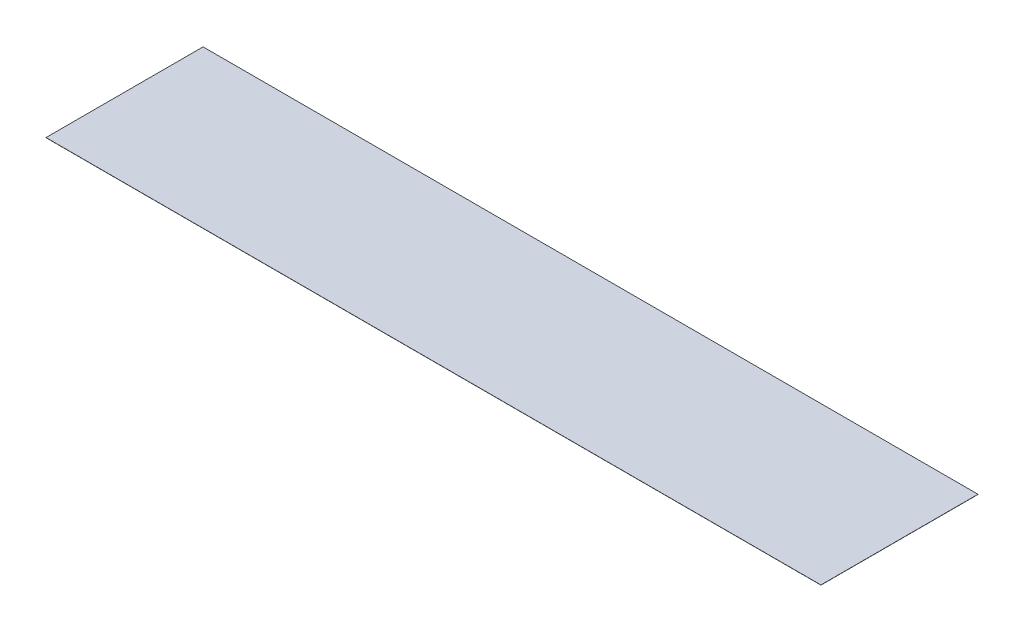
ISO-10303-21;
HEADER;
FILE_DESCRIPTION(('STEP AP214'),'2;1');
FILE_NAME('part.step','',(''),(''),'','','');
FILE_SCHEMA(('AUTOMOTIVE_DESIGN { 1 0 10303 214 1 1 1 1 }'));
ENDSEC;
DATA;
#1=APPLICATION_CONTEXT('core data for automotive mechanical design processes');
#2=APPLICATION_PROTOCOL_DEFINITION('international standard','automotive_design',2000,#1);
#3=PRODUCT_CONTEXT('',#1,'mechanical');
#4=PRODUCT('Part','Part','',(#3));
#5=PRODUCT_RELATED_PRODUCT_CATEGORY('part','',(#4));
#6=PRODUCT_DEFINITION_FORMATION('','',#4);
#7=PRODUCT_DEFINITION_CONTEXT('part definition',#1,'design');
#8=PRODUCT_DEFINITION('design','',#6,#7);
#9=PRODUCT_DEFINITION_SHAPE('','',#8);
#10=(LENGTH_UNIT() NAMED_UNIT(*) SI_UNIT(.MILLI.,.METRE.));
#11=(NAMED_UNIT(*) PLANE_ANGLE_UNIT() SI_UNIT($,.RADIAN.));
#12=(NAMED_UNIT(*) SI_UNIT($,.STERADIAN.) SOLID_ANGLE_UNIT());
#13=UNCERTAINTY_MEASURE_WITH_UNIT(LENGTH_MEASURE(1.E-05),#10,'distance_accuracy_value','');
#14=(GEOMETRIC_REPRESENTATION_CONTEXT(3) GLOBAL_UNCERTAINTY_ASSIGNED_CONTEXT((#13)) GLOBAL_UNIT_ASSIGNED_CONTEXT((#10,
#11,#12)) REPRESENTATION_CONTEXT('',''));
#15=CARTESIAN_POINT('',(0.,0.,0.));
#16=DIRECTION('',(0.,0.,1.));
#17=DIRECTION('',(1.,0.,0.));
#18=AXIS2_PLACEMENT_3D('',#15,#16,#17);
#19=CARTESIAN_POINT('',(-11277.6,4.7752,0.));
#20=DIRECTION('',(1.,0.,0.));
#21=DIRECTION('',(0.,0.,-1.));
#22=AXIS2_PLACEMENT_3D('',#19,#20,#21);
#23=PLANE('',#22);
#24=DIRECTION('',(0.,0.,1.));
#25=VECTOR('',#24,1.);
#26=CARTESIAN_POINT('',(-11277.6,0.,0.));
#27=LINE('',#26,#25);
#28=CARTESIAN_POINT('',(-11277.6,0.,-4572.));
#29=VERTEX_POINT('',#28);
#30=CARTESIAN_POINT('',(-11277.6,0.,0.));
#31=VERTEX_POINT('',#30);
#32=EDGE_CURVE('E102',#29,#31,#27,.T.);
#33=ORIENTED_EDGE('',*,*,#32,.T.);
#34=DIRECTION('',(0.,-1.,0.));
#35=VECTOR('',#34,1.);
#36=CARTESIAN_POINT('',(-11277.6,4.7752,0.));
#37=LINE('',#36,#35);
#38=CARTESIAN_POINT('',(-11277.6,4.7752,0.));
#39=VERTEX_POINT('',#38);
#40=EDGE_CURVE('E11',#39,#31,#37,.T.);
#41=ORIENTED_EDGE('',*,*,#40,.F.);
#42=DIRECTION('',(0.,0.,1.));
#43=VECTOR('',#42,1.);
#44=CARTESIAN_POINT('',(-11277.6,4.7752,0.));
#45=LINE('',#44,#43);
#46=CARTESIAN_POINT('',(-11277.6,4.7752,-4572.));
#47=VERTEX_POINT('',#46);
#48=EDGE_CURVE('E90',#47,#39,#45,.T.);
#49=ORIENTED_EDGE('',*,*,#48,.F.);
#50=DIRECTION('',(0.,-1.,0.));
#51=VECTOR('',#50,1.);
#52=CARTESIAN_POINT('',(-11277.6,4.7752,-4572.));
#53=LINE('',#52,#51);
#54=EDGE_CURVE('E98',#47,#29,#53,.T.);
#55=ORIENTED_EDGE('',*,*,#54,.T.);
#56=EDGE_LOOP('',(#33,#41,#49,#55));
#57=FACE_BOUND('',#56,.T.);
#58=ADVANCED_FACE('F39',(#57),#23,.F.);
#59=CARTESIAN_POINT('',(-11277.6,4.7752,0.));
#60=DIRECTION('',(0.,0.,-1.));
#61=DIRECTION('',(-1.,0.,0.));
#62=AXIS2_PLACEMENT_3D('',#59,#60,#61);
#63=PLANE('',#62);
#64=DIRECTION('',(1.,0.,0.));
#65=VECTOR('',#64,1.);
#66=CARTESIAN_POINT('',(-11277.6,0.,0.));
#67=LINE('',#66,#65);
#68=CARTESIAN_POINT('',(11277.6,0.,-4.21884749357559E-12));
#69=VERTEX_POINT('',#68);
#70=EDGE_CURVE('E94',#31,#69,#67,.T.);
#71=ORIENTED_EDGE('',*,*,#70,.T.);
#72=DIRECTION('',(0.,-1.,0.));
#73=VECTOR('',#72,1.);
#74=CARTESIAN_POINT('',(11277.6,4.7752,-4.21884749357559E-12));
#75=LINE('',#74,#73);
#76=CARTESIAN_POINT('',(11277.6,4.7752,-4.21884749357559E-12));
#77=VERTEX_POINT('',#76);
#78=EDGE_CURVE('E47',#77,#69,#75,.T.);
#79=ORIENTED_EDGE('',*,*,#78,.F.);
#80=DIRECTION('',(1.,0.,0.));
#81=VECTOR('',#80,1.);
#82=CARTESIAN_POINT('',(-11277.6,4.7752,0.));
#83=LINE('',#82,#81);
#84=EDGE_CURVE('E85',#39,#77,#83,.T.);
#85=ORIENTED_EDGE('',*,*,#84,.F.);
#86=ORIENTED_EDGE('',*,*,#40,.T.);
#87=EDGE_LOOP('',(#71,#79,#85,#86));
#88=FACE_BOUND('',#87,.T.);
#89=ADVANCED_FACE('F93',(#88),#63,.F.);
#90=CARTESIAN_POINT('',(11277.6,4.7752,-4.21884749357559E-12));
#91=DIRECTION('',(-1.,0.,0.));
#92=DIRECTION('',(0.,0.,1.));
#93=AXIS2_PLACEMENT_3D('',#90,#91,#92);
#94=PLANE('',#93);
#95=DIRECTION('',(0.,0.,-1.));
#96=VECTOR('',#95,1.);
#97=CARTESIAN_POINT('',(11277.6,0.,-4.21884749357559E-12));
#98=LINE('',#97,#96);
#99=CARTESIAN_POINT('',(11277.6,0.,-4572.));
#100=VERTEX_POINT('',#99);
#101=EDGE_CURVE('E72',#69,#100,#98,.T.);
#102=ORIENTED_EDGE('',*,*,#101,.T.);
#103=DIRECTION('',(0.,-1.,0.));
#104=VECTOR('',#103,1.);
#105=CARTESIAN_POINT('',(11277.6,4.7752,-4572.));
#106=LINE('',#105,#104);
#107=CARTESIAN_POINT('',(11277.6,4.7752,-4572.));
#108=VERTEX_POINT('',#107);
#109=EDGE_CURVE('E95',#108,#100,#106,.T.);
#110=ORIENTED_EDGE('',*,*,#109,.F.);
#111=DIRECTION('',(0.,0.,-1.));
#112=VECTOR('',#111,1.);
#113=CARTESIAN_POINT('',(11277.6,4.7752,-4.21884749357559E-12));
#114=LINE('',#113,#112);
#115=EDGE_CURVE('E88',#77,#108,#114,.T.);
#116=ORIENTED_EDGE('',*,*,#115,.F.);
#117=ORIENTED_EDGE('',*,*,#78,.T.);
#118=EDGE_LOOP('',(#102,#110,#116,#117));
#119=FACE_BOUND('',#118,.T.);
#120=ADVANCED_FACE('F96',(#119),#94,.F.);
#121=CARTESIAN_POINT('',(-11277.6,4.7752,-4572.));
#122=DIRECTION('',(0.,0.,1.));
#123=DIRECTION('',(1.,0.,0.));
#124=AXIS2_PLACEMENT_3D('',#121,#122,#123);
#125=PLANE('',#124);
#126=DIRECTION('',(-1.,0.,0.));
#127=VECTOR('',#126,1.);
#128=CARTESIAN_POINT('',(-11277.6,0.,-4572.));
#129=LINE('',#128,#127);
#130=EDGE_CURVE('E78',#100,#29,#129,.T.);
#131=ORIENTED_EDGE('',*,*,#130,.T.);
#132=ORIENTED_EDGE('',*,*,#54,.F.);
#133=DIRECTION('',(-1.,0.,0.));
#134=VECTOR('',#133,1.);
#135=CARTESIAN_POINT('',(-11277.6,4.7752,-4572.));
#136=LINE('',#135,#134);
#137=EDGE_CURVE('E55',#108,#47,#136,.T.);
#138=ORIENTED_EDGE('',*,*,#137,.F.);
#139=ORIENTED_EDGE('',*,*,#109,.T.);
#140=EDGE_LOOP('',(#131,#132,#138,#139));
#141=FACE_BOUND('',#140,.T.);
#142=ADVANCED_FACE('F109',(#141),#125,.F.);
#143=CARTESIAN_POINT('',(0.,4.7752,0.));
#144=DIRECTION('',(0.,-1.,0.));
#145=DIRECTION('',(0.,0.,-1.));
#146=AXIS2_PLACEMENT_3D('',#143,#144,#145);
#147=PLANE('',#146);
#148=ORIENTED_EDGE('',*,*,#48,.T.);
#149=ORIENTED_EDGE('',*,*,#84,.T.);
#150=ORIENTED_EDGE('',*,*,#115,.T.);
#151=ORIENTED_EDGE('',*,*,#137,.T.);
#152=EDGE_LOOP('',(#148,#149,#150,#151));
#153=FACE_BOUND('',#152,.T.);
#154=ADVANCED_FACE('F86',(#153),#147,.F.);
#155=CARTESIAN_POINT('',(0.,0.,0.));
#156=DIRECTION('',(0.,-1.,0.));
#157=DIRECTION('',(0.,0.,-1.));
#158=AXIS2_PLACEMENT_3D('',#155,#156,#157);
#159=PLANE('',#158);
#160=ORIENTED_EDGE('',*,*,#32,.F.);
#161=ORIENTED_EDGE('',*,*,#130,.F.);
#162=ORIENTED_EDGE('',*,*,#101,.F.);
#163=ORIENTED_EDGE('',*,*,#70,.F.);
#164=EDGE_LOOP('',(#160,#161,#162,#163));
#165=FACE_BOUND('',#164,.T.);
#166=ADVANCED_FACE('F112',(#165),#159,.T.);
#167=CLOSED_SHELL('',(#58,#89,#120,#142,#154,#166));
#168=MANIFOLD_SOLID_BREP('B2',#167);
#169=ADVANCED_BREP_SHAPE_REPRESENTATION('',(#18,#168),#14);
#170=SHAPE_DEFINITION_REPRESENTATION(#9,#169);
ENDSEC;
END-ISO-10303-21;
